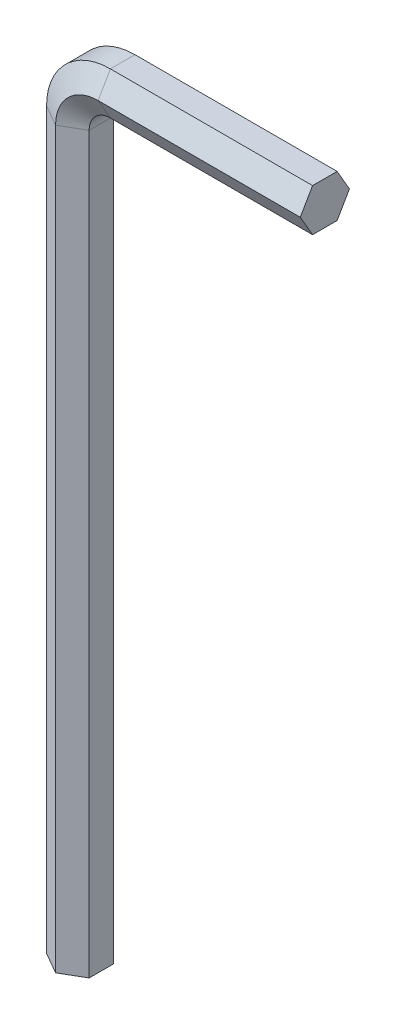
ISO-10303-21;
HEADER;
FILE_DESCRIPTION(('STEP AP214'),'2;1');
FILE_NAME('part.step','',(''),(''),'','','');
FILE_SCHEMA(('AUTOMOTIVE_DESIGN { 1 0 10303 214 1 1 1 1 }'));
ENDSEC;
DATA;
#1=APPLICATION_CONTEXT('core data for automotive mechanical design processes');
#2=APPLICATION_PROTOCOL_DEFINITION('international standard','automotive_design',2000,#1);
#3=PRODUCT_CONTEXT('',#1,'mechanical');
#4=PRODUCT('Part','Part','',(#3));
#5=PRODUCT_RELATED_PRODUCT_CATEGORY('part','',(#4));
#6=PRODUCT_DEFINITION_FORMATION('','',#4);
#7=PRODUCT_DEFINITION_CONTEXT('part definition',#1,'design');
#8=PRODUCT_DEFINITION('design','',#6,#7);
#9=PRODUCT_DEFINITION_SHAPE('','',#8);
#10=(LENGTH_UNIT() NAMED_UNIT(*) SI_UNIT(.MILLI.,.METRE.));
#11=(NAMED_UNIT(*) PLANE_ANGLE_UNIT() SI_UNIT($,.RADIAN.));
#12=(NAMED_UNIT(*) SI_UNIT($,.STERADIAN.) SOLID_ANGLE_UNIT());
#13=UNCERTAINTY_MEASURE_WITH_UNIT(LENGTH_MEASURE(1.E-05),#10,'distance_accuracy_value','');
#14=(GEOMETRIC_REPRESENTATION_CONTEXT(3) GLOBAL_UNCERTAINTY_ASSIGNED_CONTEXT((#13)) GLOBAL_UNIT_ASSIGNED_CONTEXT((#10,
#11,#12)) REPRESENTATION_CONTEXT('',''));
#15=CARTESIAN_POINT('',(0.,0.,0.));
#16=DIRECTION('',(0.,0.,1.));
#17=DIRECTION('',(1.,0.,0.));
#18=AXIS2_PLACEMENT_3D('',#15,#16,#17);
#19=CARTESIAN_POINT('',(0.,0.,0.));
#20=DIRECTION('',(0.,1.,0.));
#21=DIRECTION('',(0.,0.,1.));
#22=AXIS2_PLACEMENT_3D('',#19,#20,#21);
#23=PLANE('',#22);
#24=DIRECTION('',(-0.86602540378444,0.,-0.499999999999997));
#25=VECTOR('',#24,1.);
#26=CARTESIAN_POINT('',(4.,0.,-1.15470053837927));
#27=LINE('',#26,#25);
#28=CARTESIAN_POINT('',(4.,0.,-1.15470053837927));
#29=VERTEX_POINT('',#28);
#30=CARTESIAN_POINT('',(2.,0.,-2.30940107675851));
#31=VERTEX_POINT('',#30);
#32=EDGE_CURVE('E188',#29,#31,#27,.T.);
#33=ORIENTED_EDGE('',*,*,#32,.F.);
#34=DIRECTION('',(0.,0.,-1.));
#35=VECTOR('',#34,1.);
#36=CARTESIAN_POINT('',(4.,0.,1.15470053837924));
#37=LINE('',#36,#35);
#38=CARTESIAN_POINT('',(4.,0.,1.15470053837924));
#39=VERTEX_POINT('',#38);
#40=EDGE_CURVE('E230',#39,#29,#37,.T.);
#41=ORIENTED_EDGE('',*,*,#40,.F.);
#42=DIRECTION('',(0.866025403784437,0.,-0.500000000000003));
#43=VECTOR('',#42,1.);
#44=CARTESIAN_POINT('',(2.00000000000001,0.,2.3094010767585));
#45=LINE('',#44,#43);
#46=CARTESIAN_POINT('',(2.00000000000001,0.,2.3094010767585));
#47=VERTEX_POINT('',#46);
#48=EDGE_CURVE('E217',#47,#39,#45,.T.);
#49=ORIENTED_EDGE('',*,*,#48,.F.);
#50=DIRECTION('',(0.866025403784441,0.,0.499999999999996));
#51=VECTOR('',#50,1.);
#52=CARTESIAN_POINT('',(0.,0.,1.15470053837925));
#53=LINE('',#52,#51);
#54=CARTESIAN_POINT('',(0.,0.,1.15470053837925));
#55=VERTEX_POINT('',#54);
#56=EDGE_CURVE('E140',#55,#47,#53,.T.);
#57=ORIENTED_EDGE('',*,*,#56,.F.);
#58=DIRECTION('',(0.,0.,1.));
#59=VECTOR('',#58,1.);
#60=CARTESIAN_POINT('',(0.,0.,-1.15470053837925));
#61=LINE('',#60,#59);
#62=CARTESIAN_POINT('',(0.,0.,-1.15470053837925));
#63=VERTEX_POINT('',#62);
#64=EDGE_CURVE('E144',#63,#55,#61,.T.);
#65=ORIENTED_EDGE('',*,*,#64,.F.);
#66=DIRECTION('',(-0.866025403784437,0.,0.500000000000003));
#67=VECTOR('',#66,1.);
#68=CARTESIAN_POINT('',(2.,0.,-2.30940107675851));
#69=LINE('',#68,#67);
#70=EDGE_CURVE('E149',#31,#63,#69,.T.);
#71=ORIENTED_EDGE('',*,*,#70,.F.);
#72=EDGE_LOOP('',(#33,#41,#49,#57,#65,#71));
#73=FACE_BOUND('',#72,.T.);
#74=ADVANCED_FACE('F39',(#73),#23,.F.);
#75=CARTESIAN_POINT('',(25.,75.,0.));
#76=DIRECTION('',(1.,0.,0.));
#77=DIRECTION('',(0.,0.,1.));
#78=AXIS2_PLACEMENT_3D('',#75,#76,#77);
#79=PLANE('',#78);
#80=DIRECTION('',(0.,0.86602540378444,-0.499999999999997));
#81=VECTOR('',#80,1.);
#82=CARTESIAN_POINT('',(25.,71.,-1.15470053837927));
#83=LINE('',#82,#81);
#84=CARTESIAN_POINT('',(25.,71.,-1.15470053837927));
#85=VERTEX_POINT('',#84);
#86=CARTESIAN_POINT('',(25.,73.,-2.30940107675851));
#87=VERTEX_POINT('',#86);
#88=EDGE_CURVE('E160',#85,#87,#83,.T.);
#89=ORIENTED_EDGE('',*,*,#88,.T.);
#90=DIRECTION('',(0.,0.866025403784437,0.500000000000003));
#91=VECTOR('',#90,1.);
#92=CARTESIAN_POINT('',(25.,73.,-2.30940107675851));
#93=LINE('',#92,#91);
#94=CARTESIAN_POINT('',(25.,75.,-1.15470053837925));
#95=VERTEX_POINT('',#94);
#96=EDGE_CURVE('E163',#87,#95,#93,.T.);
#97=ORIENTED_EDGE('',*,*,#96,.T.);
#98=DIRECTION('',(0.,0.,1.));
#99=VECTOR('',#98,1.);
#100=CARTESIAN_POINT('',(25.,75.,-1.15470053837925));
#101=LINE('',#100,#99);
#102=CARTESIAN_POINT('',(25.,75.,1.15470053837925));
#103=VERTEX_POINT('',#102);
#104=EDGE_CURVE('E203',#95,#103,#101,.T.);
#105=ORIENTED_EDGE('',*,*,#104,.T.);
#106=DIRECTION('',(0.,-0.866025403784441,0.499999999999996));
#107=VECTOR('',#106,1.);
#108=CARTESIAN_POINT('',(25.,75.,1.15470053837925));
#109=LINE('',#108,#107);
#110=CARTESIAN_POINT('',(25.,73.,2.3094010767585));
#111=VERTEX_POINT('',#110);
#112=EDGE_CURVE('E58',#103,#111,#109,.T.);
#113=ORIENTED_EDGE('',*,*,#112,.T.);
#114=DIRECTION('',(0.,-0.866025403784437,-0.500000000000003));
#115=VECTOR('',#114,1.);
#116=CARTESIAN_POINT('',(25.,73.,2.3094010767585));
#117=LINE('',#116,#115);
#118=CARTESIAN_POINT('',(25.,71.,1.15470053837924));
#119=VERTEX_POINT('',#118);
#120=EDGE_CURVE('E52',#111,#119,#117,.T.);
#121=ORIENTED_EDGE('',*,*,#120,.T.);
#122=DIRECTION('',(0.,0.,-1.));
#123=VECTOR('',#122,1.);
#124=CARTESIAN_POINT('',(25.,71.,1.15470053837924));
#125=LINE('',#124,#123);
#126=EDGE_CURVE('E11',#119,#85,#125,.T.);
#127=ORIENTED_EDGE('',*,*,#126,.T.);
#128=EDGE_LOOP('',(#89,#97,#105,#113,#121,#127));
#129=FACE_BOUND('',#128,.T.);
#130=ADVANCED_FACE('F162',(#129),#79,.T.);
#131=CARTESIAN_POINT('',(4.,0.,-1.15470053837927));
#132=DIRECTION('',(0.499999999999997,0.,-0.86602540378444));
#133=DIRECTION('',(-0.86602540378444,0.,-0.499999999999997));
#134=AXIS2_PLACEMENT_3D('',#131,#132,#133);
#135=PLANE('',#134);
#136=DIRECTION('',(0.,1.,0.));
#137=VECTOR('',#136,1.);
#138=CARTESIAN_POINT('',(2.,0.,-2.30940107675851));
#139=LINE('',#138,#137);
#140=CARTESIAN_POINT('',(2.,69.,-2.30940107675851));
#141=VERTEX_POINT('',#140);
#142=EDGE_CURVE('E193',#31,#141,#139,.T.);
#143=ORIENTED_EDGE('',*,*,#142,.T.);
#144=DIRECTION('',(-0.86602540378444,0.,-0.499999999999997));
#145=VECTOR('',#144,1.);
#146=CARTESIAN_POINT('',(4.,69.,-1.15470053837927));
#147=LINE('',#146,#145);
#148=CARTESIAN_POINT('',(4.,69.,-1.15470053837927));
#149=VERTEX_POINT('',#148);
#150=EDGE_CURVE('E262',#149,#141,#147,.T.);
#151=ORIENTED_EDGE('',*,*,#150,.F.);
#152=DIRECTION('',(0.,1.,0.));
#153=VECTOR('',#152,1.);
#154=CARTESIAN_POINT('',(4.,0.,-1.15470053837927));
#155=LINE('',#154,#153);
#156=EDGE_CURVE('E244',#29,#149,#155,.T.);
#157=ORIENTED_EDGE('',*,*,#156,.F.);
#158=ORIENTED_EDGE('',*,*,#32,.T.);
#159=EDGE_LOOP('',(#143,#151,#157,#158));
#160=FACE_BOUND('',#159,.T.);
#161=ADVANCED_FACE('F269',(#160),#135,.T.);
#162=CARTESIAN_POINT('',(2.,0.,-2.30940107675851));
#163=DIRECTION('',(-0.500000000000003,0.,-0.866025403784437));
#164=DIRECTION('',(-0.866025403784437,0.,0.500000000000003));
#165=AXIS2_PLACEMENT_3D('',#162,#163,#164);
#166=PLANE('',#165);
#167=DIRECTION('',(0.,1.,0.));
#168=VECTOR('',#167,1.);
#169=CARTESIAN_POINT('',(0.,0.,-1.15470053837925));
#170=LINE('',#169,#168);
#171=CARTESIAN_POINT('',(0.,69.,-1.15470053837925));
#172=VERTEX_POINT('',#171);
#173=EDGE_CURVE('E192',#63,#172,#170,.T.);
#174=ORIENTED_EDGE('',*,*,#173,.T.);
#175=DIRECTION('',(-0.866025403784437,0.,0.500000000000003));
#176=VECTOR('',#175,1.);
#177=CARTESIAN_POINT('',(2.,69.,-2.30940107675851));
#178=LINE('',#177,#176);
#179=EDGE_CURVE('E189',#141,#172,#178,.T.);
#180=ORIENTED_EDGE('',*,*,#179,.F.);
#181=ORIENTED_EDGE('',*,*,#142,.F.);
#182=ORIENTED_EDGE('',*,*,#70,.T.);
#183=EDGE_LOOP('',(#174,#180,#181,#182));
#184=FACE_BOUND('',#183,.T.);
#185=ADVANCED_FACE('F272',(#184),#166,.T.);
#186=CARTESIAN_POINT('',(0.,0.,-1.15470053837925));
#187=DIRECTION('',(-1.,0.,0.));
#188=DIRECTION('',(0.,0.,1.));
#189=AXIS2_PLACEMENT_3D('',#186,#187,#188);
#190=PLANE('',#189);
#191=DIRECTION('',(0.,1.,0.));
#192=VECTOR('',#191,1.);
#193=CARTESIAN_POINT('',(0.,0.,1.15470053837925));
#194=LINE('',#193,#192);
#195=CARTESIAN_POINT('',(0.,69.,1.15470053837925));
#196=VERTEX_POINT('',#195);
#197=EDGE_CURVE('E206',#55,#196,#194,.T.);
#198=ORIENTED_EDGE('',*,*,#197,.T.);
#199=DIRECTION('',(0.,0.,1.));
#200=VECTOR('',#199,1.);
#201=CARTESIAN_POINT('',(0.,69.,-1.15470053837925));
#202=LINE('',#201,#200);
#203=EDGE_CURVE('E196',#172,#196,#202,.T.);
#204=ORIENTED_EDGE('',*,*,#203,.F.);
#205=ORIENTED_EDGE('',*,*,#173,.F.);
#206=ORIENTED_EDGE('',*,*,#64,.T.);
#207=EDGE_LOOP('',(#198,#204,#205,#206));
#208=FACE_BOUND('',#207,.T.);
#209=ADVANCED_FACE('F329',(#208),#190,.T.);
#210=CARTESIAN_POINT('',(0.,0.,1.15470053837925));
#211=DIRECTION('',(-0.499999999999996,0.,0.866025403784441));
#212=DIRECTION('',(0.866025403784441,0.,0.499999999999996));
#213=AXIS2_PLACEMENT_3D('',#210,#211,#212);
#214=PLANE('',#213);
#215=DIRECTION('',(0.,1.,0.));
#216=VECTOR('',#215,1.);
#217=CARTESIAN_POINT('',(2.00000000000001,0.,2.3094010767585));
#218=LINE('',#217,#216);
#219=CARTESIAN_POINT('',(2.00000000000001,69.,2.3094010767585));
#220=VERTEX_POINT('',#219);
#221=EDGE_CURVE('E219',#47,#220,#218,.T.);
#222=ORIENTED_EDGE('',*,*,#221,.T.);
#223=DIRECTION('',(0.866025403784441,0.,0.499999999999996));
#224=VECTOR('',#223,1.);
#225=CARTESIAN_POINT('',(0.,69.,1.15470053837925));
#226=LINE('',#225,#224);
#227=EDGE_CURVE('E209',#196,#220,#226,.T.);
#228=ORIENTED_EDGE('',*,*,#227,.F.);
#229=ORIENTED_EDGE('',*,*,#197,.F.);
#230=ORIENTED_EDGE('',*,*,#56,.T.);
#231=EDGE_LOOP('',(#222,#228,#229,#230));
#232=FACE_BOUND('',#231,.T.);
#233=ADVANCED_FACE('F338',(#232),#214,.T.);
#234=CARTESIAN_POINT('',(2.00000000000001,0.,2.3094010767585));
#235=DIRECTION('',(0.500000000000003,0.,0.866025403784437));
#236=DIRECTION('',(0.866025403784437,0.,-0.500000000000003));
#237=AXIS2_PLACEMENT_3D('',#234,#235,#236);
#238=PLANE('',#237);
#239=DIRECTION('',(0.,1.,0.));
#240=VECTOR('',#239,1.);
#241=CARTESIAN_POINT('',(4.,0.,1.15470053837924));
#242=LINE('',#241,#240);
#243=CARTESIAN_POINT('',(4.,69.,1.15470053837924));
#244=VERTEX_POINT('',#243);
#245=EDGE_CURVE('E232',#39,#244,#242,.T.);
#246=ORIENTED_EDGE('',*,*,#245,.T.);
#247=DIRECTION('',(0.866025403784437,0.,-0.500000000000003));
#248=VECTOR('',#247,1.);
#249=CARTESIAN_POINT('',(2.00000000000001,69.,2.3094010767585));
#250=LINE('',#249,#248);
#251=EDGE_CURVE('E222',#220,#244,#250,.T.);
#252=ORIENTED_EDGE('',*,*,#251,.F.);
#253=ORIENTED_EDGE('',*,*,#221,.F.);
#254=ORIENTED_EDGE('',*,*,#48,.T.);
#255=EDGE_LOOP('',(#246,#252,#253,#254));
#256=FACE_BOUND('',#255,.T.);
#257=ADVANCED_FACE('F349',(#256),#238,.T.);
#258=CARTESIAN_POINT('',(4.,0.,1.15470053837924));
#259=DIRECTION('',(1.,0.,0.));
#260=DIRECTION('',(0.,0.,-1.));
#261=AXIS2_PLACEMENT_3D('',#258,#259,#260);
#262=PLANE('',#261);
#263=DIRECTION('',(0.,0.,-1.));
#264=VECTOR('',#263,1.);
#265=CARTESIAN_POINT('',(4.,69.,1.15470053837924));
#266=LINE('',#265,#264);
#267=EDGE_CURVE('E235',#244,#149,#266,.T.);
#268=ORIENTED_EDGE('',*,*,#267,.F.);
#269=ORIENTED_EDGE('',*,*,#245,.F.);
#270=ORIENTED_EDGE('',*,*,#40,.T.);
#271=ORIENTED_EDGE('',*,*,#156,.T.);
#272=EDGE_LOOP('',(#268,#269,#270,#271));
#273=FACE_BOUND('',#272,.T.);
#274=ADVANCED_FACE('F285',(#273),#262,.T.);
#275=CARTESIAN_POINT('',(6.,69.,-1.15470053837927));
#276=DIRECTION('',(0.,0.,-1.));
#277=DIRECTION('',(-1.,0.,0.));
#278=AXIS2_PLACEMENT_3D('',#275,#276,#277);
#279=CONICAL_SURFACE('',#278,2.00000000000001,1.0471975511966);
#280=CARTESIAN_POINT('',(6.,69.,-2.30940107675851));
#281=DIRECTION('',(0.,0.,-1.));
#282=DIRECTION('',(-1.,0.,0.));
#283=AXIS2_PLACEMENT_3D('',#280,#281,#282);
#284=CIRCLE('',#283,4.00000000000001);
#285=CARTESIAN_POINT('',(6.,73.,-2.30940107675851));
#286=VERTEX_POINT('',#285);
#287=EDGE_CURVE('E199',#141,#286,#284,.T.);
#288=ORIENTED_EDGE('',*,*,#287,.T.);
#289=DIRECTION('',(0.,0.86602540378444,-0.499999999999997));
#290=VECTOR('',#289,1.);
#291=CARTESIAN_POINT('',(6.,71.,-1.15470053837927));
#292=LINE('',#291,#290);
#293=CARTESIAN_POINT('',(6.,71.,-1.15470053837927));
#294=VERTEX_POINT('',#293);
#295=EDGE_CURVE('E181',#294,#286,#292,.T.);
#296=ORIENTED_EDGE('',*,*,#295,.F.);
#297=CARTESIAN_POINT('',(6.,69.,-1.15470053837927));
#298=DIRECTION('',(0.,0.,-1.));
#299=DIRECTION('',(-1.,0.,0.));
#300=AXIS2_PLACEMENT_3D('',#297,#298,#299);
#301=CIRCLE('',#300,2.00000000000001);
#302=EDGE_CURVE('E246',#149,#294,#301,.T.);
#303=ORIENTED_EDGE('',*,*,#302,.F.);
#304=ORIENTED_EDGE('',*,*,#150,.T.);
#305=EDGE_LOOP('',(#288,#296,#303,#304));
#306=FACE_BOUND('',#305,.T.);
#307=ADVANCED_FACE('F252',(#306),#279,.F.);
#308=CARTESIAN_POINT('',(6.,69.,-2.30940107675851));
#309=DIRECTION('',(0.,0.,1.));
#310=DIRECTION('',(1.,0.,0.));
#311=AXIS2_PLACEMENT_3D('',#308,#309,#310);
#312=CONICAL_SURFACE('',#311,4.00000000000001,1.04719755119659);
#313=CARTESIAN_POINT('',(6.,69.,-1.15470053837925));
#314=DIRECTION('',(0.,0.,-1.));
#315=DIRECTION('',(-1.,0.,0.));
#316=AXIS2_PLACEMENT_3D('',#313,#314,#315);
#317=CIRCLE('',#316,6.00000000000002);
#318=CARTESIAN_POINT('',(6.,75.,-1.15470053837925));
#319=VERTEX_POINT('',#318);
#320=EDGE_CURVE('E127',#172,#319,#317,.T.);
#321=ORIENTED_EDGE('',*,*,#320,.T.);
#322=DIRECTION('',(0.,0.866025403784437,0.500000000000003));
#323=VECTOR('',#322,1.);
#324=CARTESIAN_POINT('',(6.,73.,-2.30940107675851));
#325=LINE('',#324,#323);
#326=EDGE_CURVE('E197',#286,#319,#325,.T.);
#327=ORIENTED_EDGE('',*,*,#326,.F.);
#328=ORIENTED_EDGE('',*,*,#287,.F.);
#329=ORIENTED_EDGE('',*,*,#179,.T.);
#330=EDGE_LOOP('',(#321,#327,#328,#329));
#331=FACE_BOUND('',#330,.T.);
#332=ADVANCED_FACE('F275',(#331),#312,.T.);
#333=CARTESIAN_POINT('',(6.,69.,0.));
#334=DIRECTION('',(0.,0.,-1.));
#335=DIRECTION('',(-1.,0.,0.));
#336=AXIS2_PLACEMENT_3D('',#333,#334,#335);
#337=CYLINDRICAL_SURFACE('',#336,6.00000000000001);
#338=CARTESIAN_POINT('',(6.,69.,1.15470053837925));
#339=DIRECTION('',(0.,0.,-1.));
#340=DIRECTION('',(-1.,0.,0.));
#341=AXIS2_PLACEMENT_3D('',#338,#339,#340);
#342=CIRCLE('',#341,6.00000000000001);
#343=CARTESIAN_POINT('',(6.,75.,1.15470053837925));
#344=VERTEX_POINT('',#343);
#345=EDGE_CURVE('E118',#196,#344,#342,.T.);
#346=ORIENTED_EDGE('',*,*,#345,.T.);
#347=DIRECTION('',(0.,0.,1.));
#348=VECTOR('',#347,1.);
#349=CARTESIAN_POINT('',(6.,75.,-1.15470053837925));
#350=LINE('',#349,#348);
#351=EDGE_CURVE('E200',#319,#344,#350,.T.);
#352=ORIENTED_EDGE('',*,*,#351,.F.);
#353=ORIENTED_EDGE('',*,*,#320,.F.);
#354=ORIENTED_EDGE('',*,*,#203,.T.);
#355=EDGE_LOOP('',(#346,#352,#353,#354));
#356=FACE_BOUND('',#355,.T.);
#357=ADVANCED_FACE('F277',(#356),#337,.T.);
#358=CARTESIAN_POINT('',(6.,69.,1.15470053837925));
#359=DIRECTION('',(0.,0.,-1.));
#360=DIRECTION('',(-1.,0.,0.));
#361=AXIS2_PLACEMENT_3D('',#358,#359,#360);
#362=CONICAL_SURFACE('',#361,6.00000000000001,1.0471975511966);
#363=CARTESIAN_POINT('',(6.,69.,2.3094010767585));
#364=DIRECTION('',(0.,0.,-1.));
#365=DIRECTION('',(-1.,0.,0.));
#366=AXIS2_PLACEMENT_3D('',#363,#364,#365);
#367=CIRCLE('',#366,4.);
#368=CARTESIAN_POINT('',(6.,73.,2.3094010767585));
#369=VERTEX_POINT('',#368);
#370=EDGE_CURVE('E111',#220,#369,#367,.T.);
#371=ORIENTED_EDGE('',*,*,#370,.T.);
#372=DIRECTION('',(0.,-0.866025403784441,0.499999999999996));
#373=VECTOR('',#372,1.);
#374=CARTESIAN_POINT('',(6.,75.,1.15470053837925));
#375=LINE('',#374,#373);
#376=EDGE_CURVE('E213',#344,#369,#375,.T.);
#377=ORIENTED_EDGE('',*,*,#376,.F.);
#378=ORIENTED_EDGE('',*,*,#345,.F.);
#379=ORIENTED_EDGE('',*,*,#227,.T.);
#380=EDGE_LOOP('',(#371,#377,#378,#379));
#381=FACE_BOUND('',#380,.T.);
#382=ADVANCED_FACE('F283',(#381),#362,.T.);
#383=CARTESIAN_POINT('',(6.,69.,2.3094010767585));
#384=DIRECTION('',(0.,0.,1.));
#385=DIRECTION('',(1.,0.,0.));
#386=AXIS2_PLACEMENT_3D('',#383,#384,#385);
#387=CONICAL_SURFACE('',#386,4.,1.04719755119659);
#388=CARTESIAN_POINT('',(6.,69.,1.15470053837924));
#389=DIRECTION('',(0.,0.,-1.));
#390=DIRECTION('',(-1.,0.,0.));
#391=AXIS2_PLACEMENT_3D('',#388,#389,#390);
#392=CIRCLE('',#391,2.00000000000001);
#393=CARTESIAN_POINT('',(6.,71.,1.15470053837924));
#394=VERTEX_POINT('',#393);
#395=EDGE_CURVE('E237',#244,#394,#392,.T.);
#396=ORIENTED_EDGE('',*,*,#395,.T.);
#397=DIRECTION('',(0.,-0.866025403784437,-0.500000000000003));
#398=VECTOR('',#397,1.);
#399=CARTESIAN_POINT('',(6.,73.,2.3094010767585));
#400=LINE('',#399,#398);
#401=EDGE_CURVE('E225',#369,#394,#400,.T.);
#402=ORIENTED_EDGE('',*,*,#401,.F.);
#403=ORIENTED_EDGE('',*,*,#370,.F.);
#404=ORIENTED_EDGE('',*,*,#251,.T.);
#405=EDGE_LOOP('',(#396,#402,#403,#404));
#406=FACE_BOUND('',#405,.T.);
#407=ADVANCED_FACE('F398',(#406),#387,.F.);
#408=CARTESIAN_POINT('',(6.,69.,0.));
#409=DIRECTION('',(0.,0.,-1.));
#410=DIRECTION('',(-1.,0.,0.));
#411=AXIS2_PLACEMENT_3D('',#408,#409,#410);
#412=CYLINDRICAL_SURFACE('',#411,2.00000000000001);
#413=DIRECTION('',(0.,0.,-1.));
#414=VECTOR('',#413,1.);
#415=CARTESIAN_POINT('',(6.,71.,1.15470053837924));
#416=LINE('',#415,#414);
#417=EDGE_CURVE('E186',#394,#294,#416,.T.);
#418=ORIENTED_EDGE('',*,*,#417,.F.);
#419=ORIENTED_EDGE('',*,*,#395,.F.);
#420=ORIENTED_EDGE('',*,*,#267,.T.);
#421=ORIENTED_EDGE('',*,*,#302,.T.);
#422=EDGE_LOOP('',(#418,#419,#420,#421));
#423=FACE_BOUND('',#422,.T.);
#424=ADVANCED_FACE('F255',(#423),#412,.F.);
#425=CARTESIAN_POINT('',(6.,71.,-1.15470053837927));
#426=DIRECTION('',(0.,-0.499999999999997,-0.86602540378444));
#427=DIRECTION('',(0.,0.86602540378444,-0.499999999999997));
#428=AXIS2_PLACEMENT_3D('',#425,#426,#427);
#429=PLANE('',#428);
#430=DIRECTION('',(1.,0.,0.));
#431=VECTOR('',#430,1.);
#432=CARTESIAN_POINT('',(6.,73.,-2.30940107675851));
#433=LINE('',#432,#431);
#434=EDGE_CURVE('E168',#286,#87,#433,.T.);
#435=ORIENTED_EDGE('',*,*,#434,.T.);
#436=ORIENTED_EDGE('',*,*,#88,.F.);
#437=DIRECTION('',(1.,0.,0.));
#438=VECTOR('',#437,1.);
#439=CARTESIAN_POINT('',(6.,71.,-1.15470053837927));
#440=LINE('',#439,#438);
#441=EDGE_CURVE('E169',#294,#85,#440,.T.);
#442=ORIENTED_EDGE('',*,*,#441,.F.);
#443=ORIENTED_EDGE('',*,*,#295,.T.);
#444=EDGE_LOOP('',(#435,#436,#442,#443));
#445=FACE_BOUND('',#444,.T.);
#446=ADVANCED_FACE('F179',(#445),#429,.T.);
#447=CARTESIAN_POINT('',(6.,73.,-2.30940107675851));
#448=DIRECTION('',(0.,0.500000000000003,-0.866025403784437));
#449=DIRECTION('',(0.,0.866025403784437,0.500000000000003));
#450=AXIS2_PLACEMENT_3D('',#447,#448,#449);
#451=PLANE('',#450);
#452=DIRECTION('',(1.,0.,0.));
#453=VECTOR('',#452,1.);
#454=CARTESIAN_POINT('',(6.,75.,-1.15470053837925));
#455=LINE('',#454,#453);
#456=EDGE_CURVE('E176',#319,#95,#455,.T.);
#457=ORIENTED_EDGE('',*,*,#456,.T.);
#458=ORIENTED_EDGE('',*,*,#96,.F.);
#459=ORIENTED_EDGE('',*,*,#434,.F.);
#460=ORIENTED_EDGE('',*,*,#326,.T.);
#461=EDGE_LOOP('',(#457,#458,#459,#460));
#462=FACE_BOUND('',#461,.T.);
#463=ADVANCED_FACE('F173',(#462),#451,.T.);
#464=CARTESIAN_POINT('',(6.,75.,-1.15470053837925));
#465=DIRECTION('',(0.,1.,0.));
#466=DIRECTION('',(0.,0.,1.));
#467=AXIS2_PLACEMENT_3D('',#464,#465,#466);
#468=PLANE('',#467);
#469=DIRECTION('',(1.,0.,0.));
#470=VECTOR('',#469,1.);
#471=CARTESIAN_POINT('',(6.,75.,1.15470053837925));
#472=LINE('',#471,#470);
#473=EDGE_CURVE('E96',#344,#103,#472,.T.);
#474=ORIENTED_EDGE('',*,*,#473,.T.);
#475=ORIENTED_EDGE('',*,*,#104,.F.);
#476=ORIENTED_EDGE('',*,*,#456,.F.);
#477=ORIENTED_EDGE('',*,*,#351,.T.);
#478=EDGE_LOOP('',(#474,#475,#476,#477));
#479=FACE_BOUND('',#478,.T.);
#480=ADVANCED_FACE('F434',(#479),#468,.T.);
#481=CARTESIAN_POINT('',(6.,75.,1.15470053837925));
#482=DIRECTION('',(0.,0.499999999999996,0.866025403784441));
#483=DIRECTION('',(0.,-0.866025403784441,0.499999999999996));
#484=AXIS2_PLACEMENT_3D('',#481,#482,#483);
#485=PLANE('',#484);
#486=DIRECTION('',(1.,0.,0.));
#487=VECTOR('',#486,1.);
#488=CARTESIAN_POINT('',(6.,73.,2.3094010767585));
#489=LINE('',#488,#487);
#490=EDGE_CURVE('E88',#369,#111,#489,.T.);
#491=ORIENTED_EDGE('',*,*,#490,.T.);
#492=ORIENTED_EDGE('',*,*,#112,.F.);
#493=ORIENTED_EDGE('',*,*,#473,.F.);
#494=ORIENTED_EDGE('',*,*,#376,.T.);
#495=EDGE_LOOP('',(#491,#492,#493,#494));
#496=FACE_BOUND('',#495,.T.);
#497=ADVANCED_FACE('F295',(#496),#485,.T.);
#498=CARTESIAN_POINT('',(6.,73.,2.3094010767585));
#499=DIRECTION('',(0.,-0.500000000000003,0.866025403784437));
#500=DIRECTION('',(0.,-0.866025403784437,-0.500000000000003));
#501=AXIS2_PLACEMENT_3D('',#498,#499,#500);
#502=PLANE('',#501);
#503=DIRECTION('',(1.,0.,0.));
#504=VECTOR('',#503,1.);
#505=CARTESIAN_POINT('',(6.,71.,1.15470053837924));
#506=LINE('',#505,#504);
#507=EDGE_CURVE('E46',#394,#119,#506,.T.);
#508=ORIENTED_EDGE('',*,*,#507,.T.);
#509=ORIENTED_EDGE('',*,*,#120,.F.);
#510=ORIENTED_EDGE('',*,*,#490,.F.);
#511=ORIENTED_EDGE('',*,*,#401,.T.);
#512=EDGE_LOOP('',(#508,#509,#510,#511));
#513=FACE_BOUND('',#512,.T.);
#514=ADVANCED_FACE('F290',(#513),#502,.T.);
#515=CARTESIAN_POINT('',(6.,71.,1.15470053837924));
#516=DIRECTION('',(0.,-1.,0.));
#517=DIRECTION('',(0.,0.,-1.));
#518=AXIS2_PLACEMENT_3D('',#515,#516,#517);
#519=PLANE('',#518);
#520=ORIENTED_EDGE('',*,*,#126,.F.);
#521=ORIENTED_EDGE('',*,*,#507,.F.);
#522=ORIENTED_EDGE('',*,*,#417,.T.);
#523=ORIENTED_EDGE('',*,*,#441,.T.);
#524=EDGE_LOOP('',(#520,#521,#522,#523));
#525=FACE_BOUND('',#524,.T.);
#526=ADVANCED_FACE('F247',(#525),#519,.T.);
#527=CLOSED_SHELL('',(#74,#130,#161,#185,#209,#233,#257,#274,#307,#332,#357,#382,#407,#424,#446,
#463,#480,#497,#514,#526));
#528=MANIFOLD_SOLID_BREP('B2',#527);
#529=ADVANCED_BREP_SHAPE_REPRESENTATION('',(#18,#528),#14);
#530=SHAPE_DEFINITION_REPRESENTATION(#9,#529);
ENDSEC;
END-ISO-10303-21;
